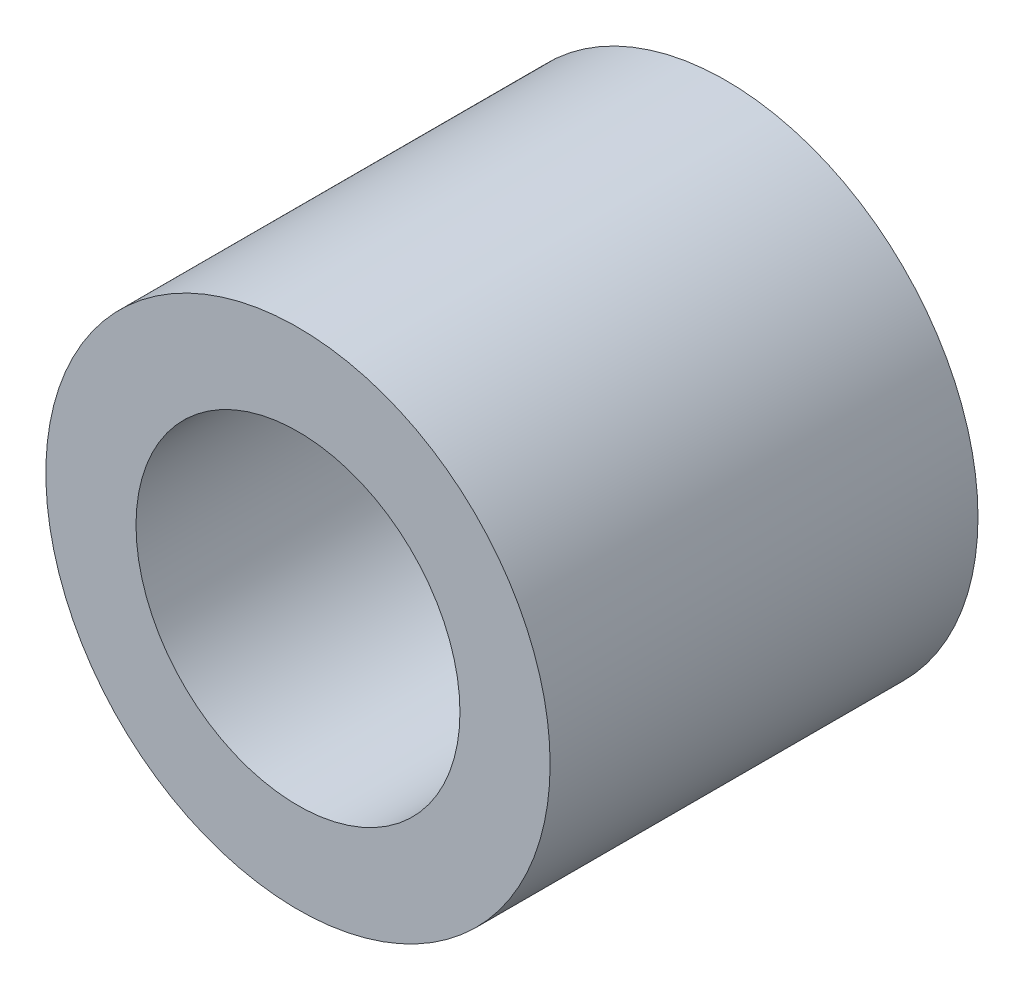
ISO-10303-21;
HEADER;
FILE_DESCRIPTION(('STEP AP214'),'2;1');
FILE_NAME('part.step','',(''),(''),'','','');
FILE_SCHEMA(('AUTOMOTIVE_DESIGN { 1 0 10303 214 1 1 1 1 }'));
ENDSEC;
DATA;
#1=APPLICATION_CONTEXT('core data for automotive mechanical design processes');
#2=APPLICATION_PROTOCOL_DEFINITION('international standard','automotive_design',2000,#1);
#3=PRODUCT_CONTEXT('',#1,'mechanical');
#4=PRODUCT('Part','Part','',(#3));
#5=PRODUCT_RELATED_PRODUCT_CATEGORY('part','',(#4));
#6=PRODUCT_DEFINITION_FORMATION('','',#4);
#7=PRODUCT_DEFINITION_CONTEXT('part definition',#1,'design');
#8=PRODUCT_DEFINITION('design','',#6,#7);
#9=PRODUCT_DEFINITION_SHAPE('','',#8);
#10=(LENGTH_UNIT() NAMED_UNIT(*) SI_UNIT(.MILLI.,.METRE.));
#11=(NAMED_UNIT(*) PLANE_ANGLE_UNIT() SI_UNIT($,.RADIAN.));
#12=(NAMED_UNIT(*) SI_UNIT($,.STERADIAN.) SOLID_ANGLE_UNIT());
#13=UNCERTAINTY_MEASURE_WITH_UNIT(LENGTH_MEASURE(1.E-05),#10,'distance_accuracy_value','');
#14=(GEOMETRIC_REPRESENTATION_CONTEXT(3) GLOBAL_UNCERTAINTY_ASSIGNED_CONTEXT((#13)) GLOBAL_UNIT_ASSIGNED_CONTEXT((#10,
#11,#12)) REPRESENTATION_CONTEXT('',''));
#15=CARTESIAN_POINT('',(0.,0.,0.));
#16=DIRECTION('',(0.,0.,1.));
#17=DIRECTION('',(1.,0.,0.));
#18=AXIS2_PLACEMENT_3D('',#15,#16,#17);
#19=CARTESIAN_POINT('',(0.,0.,7.));
#20=DIRECTION('',(0.,0.,-1.));
#21=DIRECTION('',(-1.,0.,0.));
#22=AXIS2_PLACEMENT_3D('',#19,#20,#21);
#23=CYLINDRICAL_SURFACE('',#22,4.125);
#24=CARTESIAN_POINT('',(0.,0.,7.));
#25=DIRECTION('',(0.,0.,1.));
#26=DIRECTION('',(1.,0.,0.));
#27=AXIS2_PLACEMENT_3D('',#24,#25,#26);
#28=CIRCLE('',#27,4.125);
#29=CARTESIAN_POINT('',(4.125,0.,7.));
#30=VERTEX_POINT('',#29);
#31=EDGE_CURVE('E10',#30,#30,#28,.T.);
#32=ORIENTED_EDGE('',*,*,#31,.F.);
#33=EDGE_LOOP('',(#32));
#34=FACE_BOUND('',#33,.T.);
#35=CARTESIAN_POINT('',(0.,0.,0.));
#36=DIRECTION('',(0.,0.,1.));
#37=DIRECTION('',(1.,0.,0.));
#38=AXIS2_PLACEMENT_3D('',#35,#36,#37);
#39=CIRCLE('',#38,4.125);
#40=CARTESIAN_POINT('',(4.125,0.,0.));
#41=VERTEX_POINT('',#40);
#42=EDGE_CURVE('E46',#41,#41,#39,.T.);
#43=ORIENTED_EDGE('',*,*,#42,.T.);
#44=EDGE_LOOP('',(#43));
#45=FACE_BOUND('',#44,.T.);
#46=ADVANCED_FACE('F43',(#34,#45),#23,.T.);
#47=CARTESIAN_POINT('',(0.,0.,7.));
#48=DIRECTION('',(0.,0.,1.));
#49=DIRECTION('',(1.,0.,0.));
#50=AXIS2_PLACEMENT_3D('',#47,#48,#49);
#51=PLANE('',#50);
#52=CARTESIAN_POINT('',(0.,0.,7.));
#53=DIRECTION('',(0.,0.,1.));
#54=DIRECTION('',(1.,0.,0.));
#55=AXIS2_PLACEMENT_3D('',#52,#53,#54);
#56=CIRCLE('',#55,2.65);
#57=CARTESIAN_POINT('',(2.65,0.,7.));
#58=VERTEX_POINT('',#57);
#59=EDGE_CURVE('E60',#58,#58,#56,.T.);
#60=ORIENTED_EDGE('',*,*,#59,.F.);
#61=EDGE_LOOP('',(#60));
#62=FACE_BOUND('',#61,.T.);
#63=ORIENTED_EDGE('',*,*,#31,.T.);
#64=EDGE_LOOP('',(#63));
#65=FACE_BOUND('',#64,.T.);
#66=ADVANCED_FACE('F67',(#62,#65),#51,.T.);
#67=CARTESIAN_POINT('',(0.,0.,0.));
#68=DIRECTION('',(0.,0.,1.));
#69=DIRECTION('',(1.,0.,0.));
#70=AXIS2_PLACEMENT_3D('',#67,#68,#69);
#71=PLANE('',#70);
#72=CARTESIAN_POINT('',(0.,0.,0.));
#73=DIRECTION('',(0.,0.,1.));
#74=DIRECTION('',(1.,0.,0.));
#75=AXIS2_PLACEMENT_3D('',#72,#73,#74);
#76=CIRCLE('',#75,2.65);
#77=CARTESIAN_POINT('',(2.65,0.,0.));
#78=VERTEX_POINT('',#77);
#79=EDGE_CURVE('E55',#78,#78,#76,.T.);
#80=ORIENTED_EDGE('',*,*,#79,.T.);
#81=EDGE_LOOP('',(#80));
#82=FACE_BOUND('',#81,.T.);
#83=ORIENTED_EDGE('',*,*,#42,.F.);
#84=EDGE_LOOP('',(#83));
#85=FACE_BOUND('',#84,.T.);
#86=ADVANCED_FACE('F69',(#82,#85),#71,.F.);
#87=CARTESIAN_POINT('',(0.,0.,7.));
#88=DIRECTION('',(0.,0.,1.));
#89=DIRECTION('',(1.,0.,0.));
#90=AXIS2_PLACEMENT_3D('',#87,#88,#89);
#91=CYLINDRICAL_SURFACE('',#90,2.65);
#92=ORIENTED_EDGE('',*,*,#79,.F.);
#93=EDGE_LOOP('',(#92));
#94=FACE_BOUND('',#93,.T.);
#95=ORIENTED_EDGE('',*,*,#59,.T.);
#96=EDGE_LOOP('',(#95));
#97=FACE_BOUND('',#96,.T.);
#98=ADVANCED_FACE('F65',(#94,#97),#91,.F.);
#99=CLOSED_SHELL('',(#46,#66,#86,#98));
#100=MANIFOLD_SOLID_BREP('B2',#99);
#101=ADVANCED_BREP_SHAPE_REPRESENTATION('',(#18,#100),#14);
#102=SHAPE_DEFINITION_REPRESENTATION(#9,#101);
ENDSEC;
END-ISO-10303-21;
